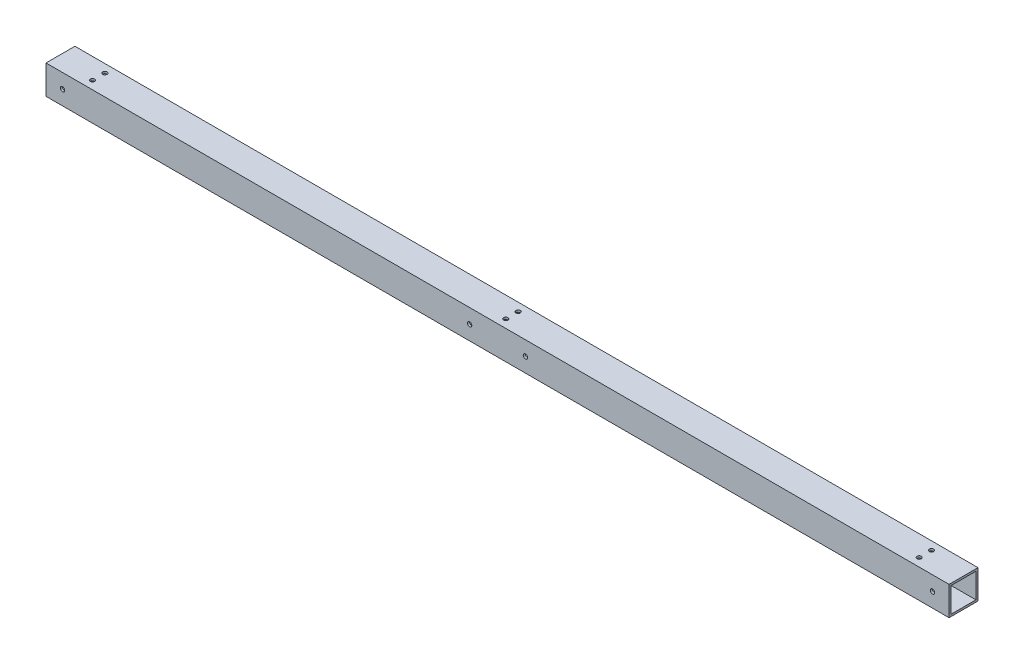
ISO-10303-21;
HEADER;
FILE_DESCRIPTION(('STEP AP214'),'2;1');
FILE_NAME('part.step','',(''),(''),'','','');
FILE_SCHEMA(('AUTOMOTIVE_DESIGN { 1 0 10303 214 1 1 1 1 }'));
ENDSEC;
DATA;
#1=APPLICATION_CONTEXT('core data for automotive mechanical design processes');
#2=APPLICATION_PROTOCOL_DEFINITION('international standard','automotive_design',2000,#1);
#3=PRODUCT_CONTEXT('',#1,'mechanical');
#4=PRODUCT('Part','Part','',(#3));
#5=PRODUCT_RELATED_PRODUCT_CATEGORY('part','',(#4));
#6=PRODUCT_DEFINITION_FORMATION('','',#4);
#7=PRODUCT_DEFINITION_CONTEXT('part definition',#1,'design');
#8=PRODUCT_DEFINITION('design','',#6,#7);
#9=PRODUCT_DEFINITION_SHAPE('','',#8);
#10=(LENGTH_UNIT() NAMED_UNIT(*) SI_UNIT(.MILLI.,.METRE.));
#11=(NAMED_UNIT(*) PLANE_ANGLE_UNIT() SI_UNIT($,.RADIAN.));
#12=(NAMED_UNIT(*) SI_UNIT($,.STERADIAN.) SOLID_ANGLE_UNIT());
#13=UNCERTAINTY_MEASURE_WITH_UNIT(LENGTH_MEASURE(1.E-05),#10,'distance_accuracy_value','');
#14=(GEOMETRIC_REPRESENTATION_CONTEXT(3) GLOBAL_UNCERTAINTY_ASSIGNED_CONTEXT((#13)) GLOBAL_UNIT_ASSIGNED_CONTEXT((#10,
#11,#12)) REPRESENTATION_CONTEXT('',''));
#15=CARTESIAN_POINT('',(0.,0.,0.));
#16=DIRECTION('',(0.,0.,1.));
#17=DIRECTION('',(1.,0.,0.));
#18=AXIS2_PLACEMENT_3D('',#15,#16,#17);
#19=CARTESIAN_POINT('',(-693.7375,-22.225,-22.225));
#20=DIRECTION('',(0.,0.,-1.));
#21=DIRECTION('',(-1.,0.,0.));
#22=AXIS2_PLACEMENT_3D('',#19,#20,#21);
#23=PLANE('',#22);
#24=CARTESIAN_POINT('',(42.8624999999999,2.33146835171283E-12,-22.225));
#25=DIRECTION('',(0.,0.,1.));
#26=DIRECTION('',(1.,0.,0.));
#27=AXIS2_PLACEMENT_3D('',#24,#25,#26);
#28=CIRCLE('',#27,3.37350099999999);
#29=CARTESIAN_POINT('',(46.2360009999999,2.33146835171283E-12,-22.225));
#30=VERTEX_POINT('',#29);
#31=EDGE_CURVE('E225',#30,#30,#28,.T.);
#32=ORIENTED_EDGE('',*,*,#31,.T.);
#33=EDGE_LOOP('',(#32));
#34=FACE_BOUND('',#33,.T.);
#35=CARTESIAN_POINT('',(-668.3375,0.,-22.225));
#36=DIRECTION('',(0.,0.,1.));
#37=DIRECTION('',(1.,0.,0.));
#38=AXIS2_PLACEMENT_3D('',#35,#36,#37);
#39=CIRCLE('',#38,3.373501);
#40=CARTESIAN_POINT('',(-664.963999,0.,-22.225));
#41=VERTEX_POINT('',#40);
#42=EDGE_CURVE('E219',#41,#41,#39,.T.);
#43=ORIENTED_EDGE('',*,*,#42,.T.);
#44=EDGE_LOOP('',(#43));
#45=FACE_BOUND('',#44,.T.);
#46=CARTESIAN_POINT('',(668.3375,2.33146835171283E-12,-22.225));
#47=DIRECTION('',(0.,0.,1.));
#48=DIRECTION('',(1.,0.,0.));
#49=AXIS2_PLACEMENT_3D('',#46,#47,#48);
#50=CIRCLE('',#49,3.373501);
#51=CARTESIAN_POINT('',(671.711001,2.33146835171283E-12,-22.225));
#52=VERTEX_POINT('',#51);
#53=EDGE_CURVE('E213',#52,#52,#50,.T.);
#54=ORIENTED_EDGE('',*,*,#53,.T.);
#55=EDGE_LOOP('',(#54));
#56=FACE_BOUND('',#55,.T.);
#57=CARTESIAN_POINT('',(-42.8625000000004,0.,-22.225));
#58=DIRECTION('',(0.,0.,1.));
#59=DIRECTION('',(1.,0.,0.));
#60=AXIS2_PLACEMENT_3D('',#57,#58,#59);
#61=CIRCLE('',#60,3.37350099999999);
#62=CARTESIAN_POINT('',(-39.4889990000004,0.,-22.225));
#63=VERTEX_POINT('',#62);
#64=EDGE_CURVE('E207',#63,#63,#61,.T.);
#65=ORIENTED_EDGE('',*,*,#64,.T.);
#66=EDGE_LOOP('',(#65));
#67=FACE_BOUND('',#66,.T.);
#68=DIRECTION('',(1.,0.,0.));
#69=VECTOR('',#68,1.);
#70=CARTESIAN_POINT('',(-693.7375,22.225,-22.225));
#71=LINE('',#70,#69);
#72=CARTESIAN_POINT('',(-693.7375,22.225,-22.225));
#73=VERTEX_POINT('',#72);
#74=CARTESIAN_POINT('',(693.7375,22.2250000000023,-22.225));
#75=VERTEX_POINT('',#74);
#76=EDGE_CURVE('E194',#73,#75,#71,.T.);
#77=ORIENTED_EDGE('',*,*,#76,.T.);
#78=DIRECTION('',(0.,1.,0.));
#79=VECTOR('',#78,1.);
#80=CARTESIAN_POINT('',(693.7375,-22.2249999999977,-22.225));
#81=LINE('',#80,#79);
#82=CARTESIAN_POINT('',(693.7375,-22.2249999999977,-22.225));
#83=VERTEX_POINT('',#82);
#84=EDGE_CURVE('E147',#83,#75,#81,.T.);
#85=ORIENTED_EDGE('',*,*,#84,.F.);
#86=DIRECTION('',(1.,0.,0.));
#87=VECTOR('',#86,1.);
#88=CARTESIAN_POINT('',(-693.7375,-22.225,-22.225));
#89=LINE('',#88,#87);
#90=CARTESIAN_POINT('',(-693.7375,-22.225,-22.225));
#91=VERTEX_POINT('',#90);
#92=EDGE_CURVE('E11',#91,#83,#89,.T.);
#93=ORIENTED_EDGE('',*,*,#92,.F.);
#94=DIRECTION('',(0.,1.,0.));
#95=VECTOR('',#94,1.);
#96=CARTESIAN_POINT('',(-693.7375,-22.225,-22.225));
#97=LINE('',#96,#95);
#98=EDGE_CURVE('E175',#91,#73,#97,.T.);
#99=ORIENTED_EDGE('',*,*,#98,.T.);
#100=EDGE_LOOP('',(#77,#85,#93,#99));
#101=FACE_BOUND('',#100,.T.);
#102=ADVANCED_FACE('F43',(#34,#45,#56,#67,#101),#23,.T.);
#103=CARTESIAN_POINT('',(-693.7375,-22.225,22.225));
#104=DIRECTION('',(0.,-1.,0.));
#105=DIRECTION('',(0.,0.,-1.));
#106=AXIS2_PLACEMENT_3D('',#103,#104,#105);
#107=PLANE('',#106);
#108=CARTESIAN_POINT('',(0.,-22.225,-9.525));
#109=DIRECTION('',(0.,-1.,0.));
#110=DIRECTION('',(0.,0.,-1.));
#111=AXIS2_PLACEMENT_3D('',#108,#109,#110);
#112=CIRCLE('',#111,3.37350099999999);
#113=CARTESIAN_POINT('',(0.,-22.225,-12.898501));
#114=VERTEX_POINT('',#113);
#115=EDGE_CURVE('E621',#114,#114,#112,.T.);
#116=ORIENTED_EDGE('',*,*,#115,.F.);
#117=EDGE_LOOP('',(#116));
#118=FACE_BOUND('',#117,.T.);
#119=CARTESIAN_POINT('',(0.,-22.225,9.525));
#120=DIRECTION('',(0.,-1.,0.));
#121=DIRECTION('',(0.,0.,-1.));
#122=AXIS2_PLACEMENT_3D('',#119,#120,#121);
#123=CIRCLE('',#122,3.37350099999999);
#124=CARTESIAN_POINT('',(0.,-22.225,6.15149900000001));
#125=VERTEX_POINT('',#124);
#126=EDGE_CURVE('E257',#125,#125,#123,.T.);
#127=ORIENTED_EDGE('',*,*,#126,.F.);
#128=EDGE_LOOP('',(#127));
#129=FACE_BOUND('',#128,.T.);
#130=CARTESIAN_POINT('',(635.,-22.2249999999977,-9.525));
#131=DIRECTION('',(0.,-1.,0.));
#132=DIRECTION('',(0.,0.,-1.));
#133=AXIS2_PLACEMENT_3D('',#130,#131,#132);
#134=CIRCLE('',#133,3.373501);
#135=CARTESIAN_POINT('',(635.,-22.2249999999977,-12.898501));
#136=VERTEX_POINT('',#135);
#137=EDGE_CURVE('E254',#136,#136,#134,.T.);
#138=ORIENTED_EDGE('',*,*,#137,.F.);
#139=EDGE_LOOP('',(#138));
#140=FACE_BOUND('',#139,.T.);
#141=CARTESIAN_POINT('',(635.,-22.2249999999977,9.525));
#142=DIRECTION('',(0.,-1.,0.));
#143=DIRECTION('',(0.,0.,-1.));
#144=AXIS2_PLACEMENT_3D('',#141,#142,#143);
#145=CIRCLE('',#144,3.373501);
#146=CARTESIAN_POINT('',(635.,-22.2249999999977,6.151499));
#147=VERTEX_POINT('',#146);
#148=EDGE_CURVE('E277',#147,#147,#145,.T.);
#149=ORIENTED_EDGE('',*,*,#148,.F.);
#150=EDGE_LOOP('',(#149));
#151=FACE_BOUND('',#150,.T.);
#152=CARTESIAN_POINT('',(-635.,-22.225,9.525));
#153=DIRECTION('',(0.,-1.,0.));
#154=DIRECTION('',(0.,0.,-1.));
#155=AXIS2_PLACEMENT_3D('',#152,#153,#154);
#156=CIRCLE('',#155,3.373501);
#157=CARTESIAN_POINT('',(-635.,-22.225,6.151499));
#158=VERTEX_POINT('',#157);
#159=EDGE_CURVE('E293',#158,#158,#156,.T.);
#160=ORIENTED_EDGE('',*,*,#159,.F.);
#161=EDGE_LOOP('',(#160));
#162=FACE_BOUND('',#161,.T.);
#163=CARTESIAN_POINT('',(-635.,-22.225,-9.525));
#164=DIRECTION('',(0.,-1.,0.));
#165=DIRECTION('',(0.,0.,-1.));
#166=AXIS2_PLACEMENT_3D('',#163,#164,#165);
#167=CIRCLE('',#166,3.373501);
#168=CARTESIAN_POINT('',(-635.,-22.225,-12.898501));
#169=VERTEX_POINT('',#168);
#170=EDGE_CURVE('E303',#169,#169,#167,.T.);
#171=ORIENTED_EDGE('',*,*,#170,.F.);
#172=EDGE_LOOP('',(#171));
#173=FACE_BOUND('',#172,.T.);
#174=ORIENTED_EDGE('',*,*,#92,.T.);
#175=DIRECTION('',(0.,0.,-1.));
#176=VECTOR('',#175,1.);
#177=CARTESIAN_POINT('',(693.7375,-22.2249999999977,22.225));
#178=LINE('',#177,#176);
#179=CARTESIAN_POINT('',(693.7375,-22.2249999999977,22.225));
#180=VERTEX_POINT('',#179);
#181=EDGE_CURVE('E159',#180,#83,#178,.T.);
#182=ORIENTED_EDGE('',*,*,#181,.F.);
#183=DIRECTION('',(1.,0.,0.));
#184=VECTOR('',#183,1.);
#185=CARTESIAN_POINT('',(-693.7375,-22.225,22.225));
#186=LINE('',#185,#184);
#187=CARTESIAN_POINT('',(-693.7375,-22.225,22.225));
#188=VERTEX_POINT('',#187);
#189=EDGE_CURVE('E52',#188,#180,#186,.T.);
#190=ORIENTED_EDGE('',*,*,#189,.F.);
#191=DIRECTION('',(0.,0.,-1.));
#192=VECTOR('',#191,1.);
#193=CARTESIAN_POINT('',(-693.7375,-22.225,22.225));
#194=LINE('',#193,#192);
#195=EDGE_CURVE('E191',#188,#91,#194,.T.);
#196=ORIENTED_EDGE('',*,*,#195,.T.);
#197=EDGE_LOOP('',(#174,#182,#190,#196));
#198=FACE_BOUND('',#197,.T.);
#199=ADVANCED_FACE('F372',(#118,#129,#140,#151,#162,#173,#198),#107,.T.);
#200=CARTESIAN_POINT('',(-693.7375,-22.225,22.225));
#201=DIRECTION('',(0.,0.,1.));
#202=DIRECTION('',(1.,0.,0.));
#203=AXIS2_PLACEMENT_3D('',#200,#201,#202);
#204=PLANE('',#203);
#205=CARTESIAN_POINT('',(42.8624999999999,2.33146835171283E-12,22.225));
#206=DIRECTION('',(0.,0.,1.));
#207=DIRECTION('',(1.,0.,0.));
#208=AXIS2_PLACEMENT_3D('',#205,#206,#207);
#209=CIRCLE('',#208,3.37350099999999);
#210=CARTESIAN_POINT('',(46.2360009999999,2.33146835171283E-12,22.225));
#211=VERTEX_POINT('',#210);
#212=EDGE_CURVE('E313',#211,#211,#209,.T.);
#213=ORIENTED_EDGE('',*,*,#212,.F.);
#214=EDGE_LOOP('',(#213));
#215=FACE_BOUND('',#214,.T.);
#216=CARTESIAN_POINT('',(-668.3375,0.,22.225));
#217=DIRECTION('',(0.,0.,1.));
#218=DIRECTION('',(1.,0.,0.));
#219=AXIS2_PLACEMENT_3D('',#216,#217,#218);
#220=CIRCLE('',#219,3.373501);
#221=CARTESIAN_POINT('',(-664.963999,0.,22.225));
#222=VERTEX_POINT('',#221);
#223=EDGE_CURVE('E323',#222,#222,#220,.T.);
#224=ORIENTED_EDGE('',*,*,#223,.F.);
#225=EDGE_LOOP('',(#224));
#226=FACE_BOUND('',#225,.T.);
#227=CARTESIAN_POINT('',(668.3375,2.33146835171283E-12,22.225));
#228=DIRECTION('',(0.,0.,1.));
#229=DIRECTION('',(1.,0.,0.));
#230=AXIS2_PLACEMENT_3D('',#227,#228,#229);
#231=CIRCLE('',#230,3.373501);
#232=CARTESIAN_POINT('',(671.711001,2.33146835171283E-12,22.225));
#233=VERTEX_POINT('',#232);
#234=EDGE_CURVE('E333',#233,#233,#231,.T.);
#235=ORIENTED_EDGE('',*,*,#234,.F.);
#236=EDGE_LOOP('',(#235));
#237=FACE_BOUND('',#236,.T.);
#238=CARTESIAN_POINT('',(-42.8625000000004,0.,22.225));
#239=DIRECTION('',(0.,0.,1.));
#240=DIRECTION('',(1.,0.,0.));
#241=AXIS2_PLACEMENT_3D('',#238,#239,#240);
#242=CIRCLE('',#241,3.37350099999999);
#243=CARTESIAN_POINT('',(-39.4889990000004,0.,22.225));
#244=VERTEX_POINT('',#243);
#245=EDGE_CURVE('E343',#244,#244,#242,.T.);
#246=ORIENTED_EDGE('',*,*,#245,.F.);
#247=EDGE_LOOP('',(#246));
#248=FACE_BOUND('',#247,.T.);
#249=ORIENTED_EDGE('',*,*,#189,.T.);
#250=DIRECTION('',(0.,-1.,0.));
#251=VECTOR('',#250,1.);
#252=CARTESIAN_POINT('',(693.7375,-22.2249999999977,22.225));
#253=LINE('',#252,#251);
#254=CARTESIAN_POINT('',(693.7375,22.2250000000023,22.225));
#255=VERTEX_POINT('',#254);
#256=EDGE_CURVE('E155',#255,#180,#253,.T.);
#257=ORIENTED_EDGE('',*,*,#256,.F.);
#258=DIRECTION('',(1.,0.,0.));
#259=VECTOR('',#258,1.);
#260=CARTESIAN_POINT('',(-693.7375,22.225,22.225));
#261=LINE('',#260,#259);
#262=CARTESIAN_POINT('',(-693.7375,22.225,22.225));
#263=VERTEX_POINT('',#262);
#264=EDGE_CURVE('E198',#263,#255,#261,.T.);
#265=ORIENTED_EDGE('',*,*,#264,.F.);
#266=DIRECTION('',(0.,-1.,0.));
#267=VECTOR('',#266,1.);
#268=CARTESIAN_POINT('',(-693.7375,-22.225,22.225));
#269=LINE('',#268,#267);
#270=EDGE_CURVE('E187',#263,#188,#269,.T.);
#271=ORIENTED_EDGE('',*,*,#270,.T.);
#272=EDGE_LOOP('',(#249,#257,#265,#271));
#273=FACE_BOUND('',#272,.T.);
#274=ADVANCED_FACE('F377',(#215,#226,#237,#248,#273),#204,.T.);
#275=CARTESIAN_POINT('',(-693.7375,22.225,22.225));
#276=DIRECTION('',(0.,1.,0.));
#277=DIRECTION('',(0.,0.,1.));
#278=AXIS2_PLACEMENT_3D('',#275,#276,#277);
#279=PLANE('',#278);
#280=CARTESIAN_POINT('',(0.,22.225,-9.525));
#281=DIRECTION('',(0.,-1.,0.));
#282=DIRECTION('',(0.,0.,-1.));
#283=AXIS2_PLACEMENT_3D('',#280,#281,#282);
#284=CIRCLE('',#283,3.37350099999999);
#285=CARTESIAN_POINT('',(0.,22.225,-12.898501));
#286=VERTEX_POINT('',#285);
#287=EDGE_CURVE('E611',#286,#286,#284,.T.);
#288=ORIENTED_EDGE('',*,*,#287,.T.);
#289=EDGE_LOOP('',(#288));
#290=FACE_BOUND('',#289,.T.);
#291=CARTESIAN_POINT('',(0.,22.225,9.525));
#292=DIRECTION('',(0.,-1.,0.));
#293=DIRECTION('',(0.,0.,-1.));
#294=AXIS2_PLACEMENT_3D('',#291,#292,#293);
#295=CIRCLE('',#294,3.37350099999999);
#296=CARTESIAN_POINT('',(0.,22.225,6.15149900000001));
#297=VERTEX_POINT('',#296);
#298=EDGE_CURVE('E247',#297,#297,#295,.T.);
#299=ORIENTED_EDGE('',*,*,#298,.T.);
#300=EDGE_LOOP('',(#299));
#301=FACE_BOUND('',#300,.T.);
#302=CARTESIAN_POINT('',(635.,22.2250000000023,-9.525));
#303=DIRECTION('',(0.,-1.,0.));
#304=DIRECTION('',(0.,0.,-1.));
#305=AXIS2_PLACEMENT_3D('',#302,#303,#304);
#306=CIRCLE('',#305,3.373501);
#307=CARTESIAN_POINT('',(635.,22.2250000000023,-12.898501));
#308=VERTEX_POINT('',#307);
#309=EDGE_CURVE('E242',#308,#308,#306,.T.);
#310=ORIENTED_EDGE('',*,*,#309,.T.);
#311=EDGE_LOOP('',(#310));
#312=FACE_BOUND('',#311,.T.);
#313=CARTESIAN_POINT('',(635.,22.2250000000023,9.525));
#314=DIRECTION('',(0.,-1.,0.));
#315=DIRECTION('',(0.,0.,-1.));
#316=AXIS2_PLACEMENT_3D('',#313,#314,#315);
#317=CIRCLE('',#316,3.373501);
#318=CARTESIAN_POINT('',(635.,22.2250000000023,6.151499));
#319=VERTEX_POINT('',#318);
#320=EDGE_CURVE('E281',#319,#319,#317,.T.);
#321=ORIENTED_EDGE('',*,*,#320,.T.);
#322=EDGE_LOOP('',(#321));
#323=FACE_BOUND('',#322,.T.);
#324=CARTESIAN_POINT('',(-635.,22.225,9.525));
#325=DIRECTION('',(0.,-1.,0.));
#326=DIRECTION('',(0.,0.,-1.));
#327=AXIS2_PLACEMENT_3D('',#324,#325,#326);
#328=CIRCLE('',#327,3.373501);
#329=CARTESIAN_POINT('',(-635.,22.225,6.151499));
#330=VERTEX_POINT('',#329);
#331=EDGE_CURVE('E237',#330,#330,#328,.T.);
#332=ORIENTED_EDGE('',*,*,#331,.T.);
#333=EDGE_LOOP('',(#332));
#334=FACE_BOUND('',#333,.T.);
#335=CARTESIAN_POINT('',(-635.,22.225,-9.525));
#336=DIRECTION('',(0.,-1.,0.));
#337=DIRECTION('',(0.,0.,-1.));
#338=AXIS2_PLACEMENT_3D('',#335,#336,#337);
#339=CIRCLE('',#338,3.373501);
#340=CARTESIAN_POINT('',(-635.,22.225,-12.898501));
#341=VERTEX_POINT('',#340);
#342=EDGE_CURVE('E231',#341,#341,#339,.T.);
#343=ORIENTED_EDGE('',*,*,#342,.T.);
#344=EDGE_LOOP('',(#343));
#345=FACE_BOUND('',#344,.T.);
#346=ORIENTED_EDGE('',*,*,#264,.T.);
#347=DIRECTION('',(0.,0.,1.));
#348=VECTOR('',#347,1.);
#349=CARTESIAN_POINT('',(693.7375,22.2250000000023,22.225));
#350=LINE('',#349,#348);
#351=EDGE_CURVE('E151',#75,#255,#350,.T.);
#352=ORIENTED_EDGE('',*,*,#351,.F.);
#353=ORIENTED_EDGE('',*,*,#76,.F.);
#354=DIRECTION('',(0.,0.,1.));
#355=VECTOR('',#354,1.);
#356=CARTESIAN_POINT('',(-693.7375,22.225,22.225));
#357=LINE('',#356,#355);
#358=EDGE_CURVE('E183',#73,#263,#357,.T.);
#359=ORIENTED_EDGE('',*,*,#358,.T.);
#360=EDGE_LOOP('',(#346,#352,#353,#359));
#361=FACE_BOUND('',#360,.T.);
#362=ADVANCED_FACE('F389',(#290,#301,#312,#323,#334,#345,#361),#279,.T.);
#363=CARTESIAN_POINT('',(-693.7375,0.,0.));
#364=DIRECTION('',(-1.,0.,0.));
#365=DIRECTION('',(0.,0.,1.));
#366=AXIS2_PLACEMENT_3D('',#363,#364,#365);
#367=PLANE('',#366);
#368=DIRECTION('',(0.,1.,0.));
#369=VECTOR('',#368,1.);
#370=CARTESIAN_POINT('',(-693.7375,-19.05,-19.05));
#371=LINE('',#370,#369);
#372=CARTESIAN_POINT('',(-693.7375,-19.05,-19.05));
#373=VERTEX_POINT('',#372);
#374=CARTESIAN_POINT('',(-693.7375,19.05,-19.05));
#375=VERTEX_POINT('',#374);
#376=EDGE_CURVE('E163',#373,#375,#371,.T.);
#377=ORIENTED_EDGE('',*,*,#376,.T.);
#378=DIRECTION('',(0.,0.,1.));
#379=VECTOR('',#378,1.);
#380=CARTESIAN_POINT('',(-693.7375,19.05,19.05));
#381=LINE('',#380,#379);
#382=CARTESIAN_POINT('',(-693.7375,19.05,19.05));
#383=VERTEX_POINT('',#382);
#384=EDGE_CURVE('E116',#375,#383,#381,.T.);
#385=ORIENTED_EDGE('',*,*,#384,.T.);
#386=DIRECTION('',(0.,-1.,0.));
#387=VECTOR('',#386,1.);
#388=CARTESIAN_POINT('',(-693.7375,-19.05,19.05));
#389=LINE('',#388,#387);
#390=CARTESIAN_POINT('',(-693.7375,-19.05,19.05));
#391=VERTEX_POINT('',#390);
#392=EDGE_CURVE('E60',#383,#391,#389,.T.);
#393=ORIENTED_EDGE('',*,*,#392,.T.);
#394=DIRECTION('',(0.,0.,-1.));
#395=VECTOR('',#394,1.);
#396=CARTESIAN_POINT('',(-693.7375,-19.05,19.05));
#397=LINE('',#396,#395);
#398=EDGE_CURVE('E122',#391,#373,#397,.T.);
#399=ORIENTED_EDGE('',*,*,#398,.T.);
#400=EDGE_LOOP('',(#377,#385,#393,#399));
#401=FACE_BOUND('',#400,.T.);
#402=ORIENTED_EDGE('',*,*,#98,.F.);
#403=ORIENTED_EDGE('',*,*,#195,.F.);
#404=ORIENTED_EDGE('',*,*,#270,.F.);
#405=ORIENTED_EDGE('',*,*,#358,.F.);
#406=EDGE_LOOP('',(#402,#403,#404,#405));
#407=FACE_BOUND('',#406,.T.);
#408=ADVANCED_FACE('F397',(#401,#407),#367,.T.);
#409=CARTESIAN_POINT('',(-693.7375,-19.05,-19.05));
#410=DIRECTION('',(0.,0.,-1.));
#411=DIRECTION('',(-1.,0.,0.));
#412=AXIS2_PLACEMENT_3D('',#409,#410,#411);
#413=PLANE('',#412);
#414=CARTESIAN_POINT('',(42.8624999999999,2.33146835171283E-12,-19.05));
#415=DIRECTION('',(0.,0.,-1.));
#416=DIRECTION('',(-1.,0.,0.));
#417=AXIS2_PLACEMENT_3D('',#414,#415,#416);
#418=CIRCLE('',#417,3.37350099999999);
#419=CARTESIAN_POINT('',(39.4889989999999,2.33146835171283E-12,-19.05));
#420=VERTEX_POINT('',#419);
#421=EDGE_CURVE('E224',#420,#420,#418,.T.);
#422=ORIENTED_EDGE('',*,*,#421,.T.);
#423=EDGE_LOOP('',(#422));
#424=FACE_BOUND('',#423,.T.);
#425=CARTESIAN_POINT('',(-668.3375,0.,-19.05));
#426=DIRECTION('',(0.,0.,-1.));
#427=DIRECTION('',(-1.,0.,0.));
#428=AXIS2_PLACEMENT_3D('',#425,#426,#427);
#429=CIRCLE('',#428,3.373501);
#430=CARTESIAN_POINT('',(-671.711001,0.,-19.05));
#431=VERTEX_POINT('',#430);
#432=EDGE_CURVE('E214',#431,#431,#429,.T.);
#433=ORIENTED_EDGE('',*,*,#432,.T.);
#434=EDGE_LOOP('',(#433));
#435=FACE_BOUND('',#434,.T.);
#436=CARTESIAN_POINT('',(668.3375,2.33146835171283E-12,-19.05));
#437=DIRECTION('',(0.,0.,-1.));
#438=DIRECTION('',(-1.,0.,0.));
#439=AXIS2_PLACEMENT_3D('',#436,#437,#438);
#440=CIRCLE('',#439,3.373501);
#441=CARTESIAN_POINT('',(664.963999,2.33146835171283E-12,-19.05));
#442=VERTEX_POINT('',#441);
#443=EDGE_CURVE('E208',#442,#442,#440,.T.);
#444=ORIENTED_EDGE('',*,*,#443,.T.);
#445=EDGE_LOOP('',(#444));
#446=FACE_BOUND('',#445,.T.);
#447=CARTESIAN_POINT('',(-42.8625000000004,0.,-19.05));
#448=DIRECTION('',(0.,0.,-1.));
#449=DIRECTION('',(-1.,0.,0.));
#450=AXIS2_PLACEMENT_3D('',#447,#448,#449);
#451=CIRCLE('',#450,3.37350099999999);
#452=CARTESIAN_POINT('',(-46.2360010000003,0.,-19.05));
#453=VERTEX_POINT('',#452);
#454=EDGE_CURVE('E132',#453,#453,#451,.T.);
#455=ORIENTED_EDGE('',*,*,#454,.T.);
#456=EDGE_LOOP('',(#455));
#457=FACE_BOUND('',#456,.T.);
#458=DIRECTION('',(1.,0.,0.));
#459=VECTOR('',#458,1.);
#460=CARTESIAN_POINT('',(-693.7375,-19.05,-19.05));
#461=LINE('',#460,#459);
#462=CARTESIAN_POINT('',(693.7375,-19.0499999999977,-19.05));
#463=VERTEX_POINT('',#462);
#464=EDGE_CURVE('E127',#373,#463,#461,.T.);
#465=ORIENTED_EDGE('',*,*,#464,.T.);
#466=DIRECTION('',(0.,1.,0.));
#467=VECTOR('',#466,1.);
#468=CARTESIAN_POINT('',(693.7375,-19.0499999999977,-19.05));
#469=LINE('',#468,#467);
#470=CARTESIAN_POINT('',(693.7375,19.0500000000023,-19.05));
#471=VERTEX_POINT('',#470);
#472=EDGE_CURVE('E125',#463,#471,#469,.T.);
#473=ORIENTED_EDGE('',*,*,#472,.T.);
#474=DIRECTION('',(1.,0.,0.));
#475=VECTOR('',#474,1.);
#476=CARTESIAN_POINT('',(-693.7375,19.05,-19.05));
#477=LINE('',#476,#475);
#478=EDGE_CURVE('E109',#375,#471,#477,.T.);
#479=ORIENTED_EDGE('',*,*,#478,.F.);
#480=ORIENTED_EDGE('',*,*,#376,.F.);
#481=EDGE_LOOP('',(#465,#473,#479,#480));
#482=FACE_BOUND('',#481,.T.);
#483=ADVANCED_FACE('F126',(#424,#435,#446,#457,#482),#413,.F.);
#484=CARTESIAN_POINT('',(-693.7375,-19.05,19.05));
#485=DIRECTION('',(0.,-1.,0.));
#486=DIRECTION('',(0.,0.,-1.));
#487=AXIS2_PLACEMENT_3D('',#484,#485,#486);
#488=PLANE('',#487);
#489=CARTESIAN_POINT('',(0.,-19.05,-9.525));
#490=DIRECTION('',(0.,-1.,0.));
#491=DIRECTION('',(0.,0.,-1.));
#492=AXIS2_PLACEMENT_3D('',#489,#490,#491);
#493=CIRCLE('',#492,3.37350099999999);
#494=CARTESIAN_POINT('',(0.,-19.05,-12.898501));
#495=VERTEX_POINT('',#494);
#496=EDGE_CURVE('E46',#495,#495,#493,.T.);
#497=ORIENTED_EDGE('',*,*,#496,.T.);
#498=EDGE_LOOP('',(#497));
#499=FACE_BOUND('',#498,.T.);
#500=CARTESIAN_POINT('',(0.,-19.05,9.525));
#501=DIRECTION('',(0.,-1.,0.));
#502=DIRECTION('',(0.,0.,-1.));
#503=AXIS2_PLACEMENT_3D('',#500,#501,#502);
#504=CIRCLE('',#503,3.37350099999999);
#505=CARTESIAN_POINT('',(0.,-19.05,6.15149900000001));
#506=VERTEX_POINT('',#505);
#507=EDGE_CURVE('E246',#506,#506,#504,.T.);
#508=ORIENTED_EDGE('',*,*,#507,.T.);
#509=EDGE_LOOP('',(#508));
#510=FACE_BOUND('',#509,.T.);
#511=CARTESIAN_POINT('',(635.,-19.0499999999977,-9.525));
#512=DIRECTION('',(0.,-1.,0.));
#513=DIRECTION('',(0.,0.,-1.));
#514=AXIS2_PLACEMENT_3D('',#511,#512,#513);
#515=CIRCLE('',#514,3.373501);
#516=CARTESIAN_POINT('',(635.,-19.0499999999977,-12.898501));
#517=VERTEX_POINT('',#516);
#518=EDGE_CURVE('E241',#517,#517,#515,.T.);
#519=ORIENTED_EDGE('',*,*,#518,.T.);
#520=EDGE_LOOP('',(#519));
#521=FACE_BOUND('',#520,.T.);
#522=CARTESIAN_POINT('',(635.,-19.0499999999977,9.525));
#523=DIRECTION('',(0.,-1.,0.));
#524=DIRECTION('',(0.,0.,-1.));
#525=AXIS2_PLACEMENT_3D('',#522,#523,#524);
#526=CIRCLE('',#525,3.373501);
#527=CARTESIAN_POINT('',(635.,-19.0499999999977,6.151499));
#528=VERTEX_POINT('',#527);
#529=EDGE_CURVE('E285',#528,#528,#526,.T.);
#530=ORIENTED_EDGE('',*,*,#529,.T.);
#531=EDGE_LOOP('',(#530));
#532=FACE_BOUND('',#531,.T.);
#533=CARTESIAN_POINT('',(-635.,-19.05,9.525));
#534=DIRECTION('',(0.,-1.,0.));
#535=DIRECTION('',(0.,0.,-1.));
#536=AXIS2_PLACEMENT_3D('',#533,#534,#535);
#537=CIRCLE('',#536,3.373501);
#538=CARTESIAN_POINT('',(-635.,-19.05,6.151499));
#539=VERTEX_POINT('',#538);
#540=EDGE_CURVE('E236',#539,#539,#537,.T.);
#541=ORIENTED_EDGE('',*,*,#540,.T.);
#542=EDGE_LOOP('',(#541));
#543=FACE_BOUND('',#542,.T.);
#544=CARTESIAN_POINT('',(-635.,-19.05,-9.525));
#545=DIRECTION('',(0.,-1.,0.));
#546=DIRECTION('',(0.,0.,-1.));
#547=AXIS2_PLACEMENT_3D('',#544,#545,#546);
#548=CIRCLE('',#547,3.373501);
#549=CARTESIAN_POINT('',(-635.,-19.05,-12.898501));
#550=VERTEX_POINT('',#549);
#551=EDGE_CURVE('E226',#550,#550,#548,.T.);
#552=ORIENTED_EDGE('',*,*,#551,.T.);
#553=EDGE_LOOP('',(#552));
#554=FACE_BOUND('',#553,.T.);
#555=DIRECTION('',(1.,0.,0.));
#556=VECTOR('',#555,1.);
#557=CARTESIAN_POINT('',(-693.7375,-19.05,19.05));
#558=LINE('',#557,#556);
#559=CARTESIAN_POINT('',(693.7375,-19.0499999999977,19.05));
#560=VERTEX_POINT('',#559);
#561=EDGE_CURVE('E176',#391,#560,#558,.T.);
#562=ORIENTED_EDGE('',*,*,#561,.T.);
#563=DIRECTION('',(0.,0.,-1.));
#564=VECTOR('',#563,1.);
#565=CARTESIAN_POINT('',(693.7375,-19.0499999999977,19.05));
#566=LINE('',#565,#564);
#567=EDGE_CURVE('E141',#560,#463,#566,.T.);
#568=ORIENTED_EDGE('',*,*,#567,.T.);
#569=ORIENTED_EDGE('',*,*,#464,.F.);
#570=ORIENTED_EDGE('',*,*,#398,.F.);
#571=EDGE_LOOP('',(#562,#568,#569,#570));
#572=FACE_BOUND('',#571,.T.);
#573=ADVANCED_FACE('F414',(#499,#510,#521,#532,#543,#554,#572),#488,.F.);
#574=CARTESIAN_POINT('',(-693.7375,-19.05,19.05));
#575=DIRECTION('',(0.,0.,1.));
#576=DIRECTION('',(1.,0.,0.));
#577=AXIS2_PLACEMENT_3D('',#574,#575,#576);
#578=PLANE('',#577);
#579=CARTESIAN_POINT('',(42.8624999999999,2.33146835171283E-12,19.05));
#580=DIRECTION('',(0.,0.,1.));
#581=DIRECTION('',(1.,0.,0.));
#582=AXIS2_PLACEMENT_3D('',#579,#580,#581);
#583=CIRCLE('',#582,3.37350099999999);
#584=CARTESIAN_POINT('',(46.2360009999999,2.33146835171283E-12,19.05));
#585=VERTEX_POINT('',#584);
#586=EDGE_CURVE('E220',#585,#585,#583,.T.);
#587=ORIENTED_EDGE('',*,*,#586,.T.);
#588=EDGE_LOOP('',(#587));
#589=FACE_BOUND('',#588,.T.);
#590=CARTESIAN_POINT('',(-668.3375,0.,19.05));
#591=DIRECTION('',(0.,0.,1.));
#592=DIRECTION('',(1.,0.,0.));
#593=AXIS2_PLACEMENT_3D('',#590,#591,#592);
#594=CIRCLE('',#593,3.373501);
#595=CARTESIAN_POINT('',(-664.963999,0.,19.05));
#596=VERTEX_POINT('',#595);
#597=EDGE_CURVE('E218',#596,#596,#594,.T.);
#598=ORIENTED_EDGE('',*,*,#597,.T.);
#599=EDGE_LOOP('',(#598));
#600=FACE_BOUND('',#599,.T.);
#601=CARTESIAN_POINT('',(668.3375,2.33146835171283E-12,19.05));
#602=DIRECTION('',(0.,0.,1.));
#603=DIRECTION('',(1.,0.,0.));
#604=AXIS2_PLACEMENT_3D('',#601,#602,#603);
#605=CIRCLE('',#604,3.373501);
#606=CARTESIAN_POINT('',(671.711001,2.33146835171283E-12,19.05));
#607=VERTEX_POINT('',#606);
#608=EDGE_CURVE('E212',#607,#607,#605,.T.);
#609=ORIENTED_EDGE('',*,*,#608,.T.);
#610=EDGE_LOOP('',(#609));
#611=FACE_BOUND('',#610,.T.);
#612=CARTESIAN_POINT('',(-42.8625000000004,0.,19.05));
#613=DIRECTION('',(0.,0.,1.));
#614=DIRECTION('',(1.,0.,0.));
#615=AXIS2_PLACEMENT_3D('',#612,#613,#614);
#616=CIRCLE('',#615,3.37350099999999);
#617=CARTESIAN_POINT('',(-39.4889990000004,0.,19.05));
#618=VERTEX_POINT('',#617);
#619=EDGE_CURVE('E203',#618,#618,#616,.T.);
#620=ORIENTED_EDGE('',*,*,#619,.T.);
#621=EDGE_LOOP('',(#620));
#622=FACE_BOUND('',#621,.T.);
#623=DIRECTION('',(1.,0.,0.));
#624=VECTOR('',#623,1.);
#625=CARTESIAN_POINT('',(-693.7375,19.05,19.05));
#626=LINE('',#625,#624);
#627=CARTESIAN_POINT('',(693.7375,19.0500000000023,19.05));
#628=VERTEX_POINT('',#627);
#629=EDGE_CURVE('E121',#383,#628,#626,.T.);
#630=ORIENTED_EDGE('',*,*,#629,.T.);
#631=DIRECTION('',(0.,-1.,0.));
#632=VECTOR('',#631,1.);
#633=CARTESIAN_POINT('',(693.7375,-19.0499999999977,19.05));
#634=LINE('',#633,#632);
#635=EDGE_CURVE('E136',#628,#560,#634,.T.);
#636=ORIENTED_EDGE('',*,*,#635,.T.);
#637=ORIENTED_EDGE('',*,*,#561,.F.);
#638=ORIENTED_EDGE('',*,*,#392,.F.);
#639=EDGE_LOOP('',(#630,#636,#637,#638));
#640=FACE_BOUND('',#639,.T.);
#641=ADVANCED_FACE('F418',(#589,#600,#611,#622,#640),#578,.F.);
#642=CARTESIAN_POINT('',(-693.7375,19.05,19.05));
#643=DIRECTION('',(0.,1.,0.));
#644=DIRECTION('',(0.,0.,1.));
#645=AXIS2_PLACEMENT_3D('',#642,#643,#644);
#646=PLANE('',#645);
#647=CARTESIAN_POINT('',(0.,19.05,-9.525));
#648=DIRECTION('',(0.,1.,0.));
#649=DIRECTION('',(0.,0.,1.));
#650=AXIS2_PLACEMENT_3D('',#647,#648,#649);
#651=CIRCLE('',#650,3.37350099999999);
#652=CARTESIAN_POINT('',(0.,19.05,-6.15149900000001));
#653=VERTEX_POINT('',#652);
#654=EDGE_CURVE('E264',#653,#653,#651,.T.);
#655=ORIENTED_EDGE('',*,*,#654,.T.);
#656=EDGE_LOOP('',(#655));
#657=FACE_BOUND('',#656,.T.);
#658=CARTESIAN_POINT('',(0.,19.05,9.525));
#659=DIRECTION('',(0.,1.,0.));
#660=DIRECTION('',(0.,0.,1.));
#661=AXIS2_PLACEMENT_3D('',#658,#659,#660);
#662=CIRCLE('',#661,3.37350099999999);
#663=CARTESIAN_POINT('',(0.,19.05,12.898501));
#664=VERTEX_POINT('',#663);
#665=EDGE_CURVE('E243',#664,#664,#662,.T.);
#666=ORIENTED_EDGE('',*,*,#665,.T.);
#667=EDGE_LOOP('',(#666));
#668=FACE_BOUND('',#667,.T.);
#669=CARTESIAN_POINT('',(635.,19.0500000000023,-9.525));
#670=DIRECTION('',(0.,1.,0.));
#671=DIRECTION('',(0.,0.,1.));
#672=AXIS2_PLACEMENT_3D('',#669,#670,#671);
#673=CIRCLE('',#672,3.373501);
#674=CARTESIAN_POINT('',(635.,19.0500000000023,-6.151499));
#675=VERTEX_POINT('',#674);
#676=EDGE_CURVE('E238',#675,#675,#673,.T.);
#677=ORIENTED_EDGE('',*,*,#676,.T.);
#678=EDGE_LOOP('',(#677));
#679=FACE_BOUND('',#678,.T.);
#680=CARTESIAN_POINT('',(635.,19.0500000000023,9.525));
#681=DIRECTION('',(0.,1.,0.));
#682=DIRECTION('',(0.,0.,1.));
#683=AXIS2_PLACEMENT_3D('',#680,#681,#682);
#684=CIRCLE('',#683,3.373501);
#685=CARTESIAN_POINT('',(635.,19.0500000000023,12.898501));
#686=VERTEX_POINT('',#685);
#687=EDGE_CURVE('E289',#686,#686,#684,.T.);
#688=ORIENTED_EDGE('',*,*,#687,.T.);
#689=EDGE_LOOP('',(#688));
#690=FACE_BOUND('',#689,.T.);
#691=CARTESIAN_POINT('',(-635.,19.05,9.525));
#692=DIRECTION('',(0.,1.,0.));
#693=DIRECTION('',(0.,0.,1.));
#694=AXIS2_PLACEMENT_3D('',#691,#692,#693);
#695=CIRCLE('',#694,3.373501);
#696=CARTESIAN_POINT('',(-635.,19.05,12.898501));
#697=VERTEX_POINT('',#696);
#698=EDGE_CURVE('E232',#697,#697,#695,.T.);
#699=ORIENTED_EDGE('',*,*,#698,.T.);
#700=EDGE_LOOP('',(#699));
#701=FACE_BOUND('',#700,.T.);
#702=CARTESIAN_POINT('',(-635.,19.05,-9.525));
#703=DIRECTION('',(0.,1.,0.));
#704=DIRECTION('',(0.,0.,1.));
#705=AXIS2_PLACEMENT_3D('',#702,#703,#704);
#706=CIRCLE('',#705,3.373501);
#707=CARTESIAN_POINT('',(-635.,19.05,-6.151499));
#708=VERTEX_POINT('',#707);
#709=EDGE_CURVE('E230',#708,#708,#706,.T.);
#710=ORIENTED_EDGE('',*,*,#709,.T.);
#711=EDGE_LOOP('',(#710));
#712=FACE_BOUND('',#711,.T.);
#713=ORIENTED_EDGE('',*,*,#478,.T.);
#714=DIRECTION('',(0.,0.,1.));
#715=VECTOR('',#714,1.);
#716=CARTESIAN_POINT('',(693.7375,19.0500000000023,19.05));
#717=LINE('',#716,#715);
#718=EDGE_CURVE('E113',#471,#628,#717,.T.);
#719=ORIENTED_EDGE('',*,*,#718,.T.);
#720=ORIENTED_EDGE('',*,*,#629,.F.);
#721=ORIENTED_EDGE('',*,*,#384,.F.);
#722=EDGE_LOOP('',(#713,#719,#720,#721));
#723=FACE_BOUND('',#722,.T.);
#724=ADVANCED_FACE('F111',(#657,#668,#679,#690,#701,#712,#723),#646,.F.);
#725=CARTESIAN_POINT('',(693.7375,2.33146835171283E-12,0.));
#726=DIRECTION('',(-1.,0.,0.));
#727=DIRECTION('',(0.,0.,1.));
#728=AXIS2_PLACEMENT_3D('',#725,#726,#727);
#729=PLANE('',#728);
#730=ORIENTED_EDGE('',*,*,#84,.T.);
#731=ORIENTED_EDGE('',*,*,#351,.T.);
#732=ORIENTED_EDGE('',*,*,#256,.T.);
#733=ORIENTED_EDGE('',*,*,#181,.T.);
#734=EDGE_LOOP('',(#730,#731,#732,#733));
#735=FACE_BOUND('',#734,.T.);
#736=ORIENTED_EDGE('',*,*,#472,.F.);
#737=ORIENTED_EDGE('',*,*,#567,.F.);
#738=ORIENTED_EDGE('',*,*,#635,.F.);
#739=ORIENTED_EDGE('',*,*,#718,.F.);
#740=EDGE_LOOP('',(#736,#737,#738,#739));
#741=FACE_BOUND('',#740,.T.);
#742=ADVANCED_FACE('F134',(#735,#741),#729,.F.);
#743=CARTESIAN_POINT('',(-42.8625000000004,0.,22.225));
#744=DIRECTION('',(0.,0.,1.));
#745=DIRECTION('',(1.,0.,0.));
#746=AXIS2_PLACEMENT_3D('',#743,#744,#745);
#747=CYLINDRICAL_SURFACE('',#746,3.37350099999999);
#748=ORIENTED_EDGE('',*,*,#245,.T.);
#749=EDGE_LOOP('',(#748));
#750=FACE_BOUND('',#749,.T.);
#751=ORIENTED_EDGE('',*,*,#619,.F.);
#752=EDGE_LOOP('',(#751));
#753=FACE_BOUND('',#752,.T.);
#754=ADVANCED_FACE('F358',(#750,#753),#747,.F.);
#755=ORIENTED_EDGE('',*,*,#64,.F.);
#756=EDGE_LOOP('',(#755));
#757=FACE_BOUND('',#756,.T.);
#758=ORIENTED_EDGE('',*,*,#454,.F.);
#759=EDGE_LOOP('',(#758));
#760=FACE_BOUND('',#759,.T.);
#761=ADVANCED_FACE('F355',(#757,#760),#747,.F.);
#762=CARTESIAN_POINT('',(668.3375,2.33146835171283E-12,22.225));
#763=DIRECTION('',(0.,0.,1.));
#764=DIRECTION('',(1.,0.,0.));
#765=AXIS2_PLACEMENT_3D('',#762,#763,#764);
#766=CYLINDRICAL_SURFACE('',#765,3.373501);
#767=ORIENTED_EDGE('',*,*,#53,.F.);
#768=EDGE_LOOP('',(#767));
#769=FACE_BOUND('',#768,.T.);
#770=ORIENTED_EDGE('',*,*,#443,.F.);
#771=EDGE_LOOP('',(#770));
#772=FACE_BOUND('',#771,.T.);
#773=ADVANCED_FACE('F357',(#769,#772),#766,.F.);
#774=ORIENTED_EDGE('',*,*,#234,.T.);
#775=EDGE_LOOP('',(#774));
#776=FACE_BOUND('',#775,.T.);
#777=ORIENTED_EDGE('',*,*,#608,.F.);
#778=EDGE_LOOP('',(#777));
#779=FACE_BOUND('',#778,.T.);
#780=ADVANCED_FACE('F365',(#776,#779),#766,.F.);
#781=CARTESIAN_POINT('',(-668.3375,0.,22.225));
#782=DIRECTION('',(0.,0.,1.));
#783=DIRECTION('',(1.,0.,0.));
#784=AXIS2_PLACEMENT_3D('',#781,#782,#783);
#785=CYLINDRICAL_SURFACE('',#784,3.373501);
#786=ORIENTED_EDGE('',*,*,#42,.F.);
#787=EDGE_LOOP('',(#786));
#788=FACE_BOUND('',#787,.T.);
#789=ORIENTED_EDGE('',*,*,#432,.F.);
#790=EDGE_LOOP('',(#789));
#791=FACE_BOUND('',#790,.T.);
#792=ADVANCED_FACE('F453',(#788,#791),#785,.F.);
#793=ORIENTED_EDGE('',*,*,#223,.T.);
#794=EDGE_LOOP('',(#793));
#795=FACE_BOUND('',#794,.T.);
#796=ORIENTED_EDGE('',*,*,#597,.F.);
#797=EDGE_LOOP('',(#796));
#798=FACE_BOUND('',#797,.T.);
#799=ADVANCED_FACE('F462',(#795,#798),#785,.F.);
#800=CARTESIAN_POINT('',(42.8624999999999,2.33146835171283E-12,22.225));
#801=DIRECTION('',(0.,0.,1.));
#802=DIRECTION('',(1.,0.,0.));
#803=AXIS2_PLACEMENT_3D('',#800,#801,#802);
#804=CYLINDRICAL_SURFACE('',#803,3.37350099999999);
#805=ORIENTED_EDGE('',*,*,#212,.T.);
#806=EDGE_LOOP('',(#805));
#807=FACE_BOUND('',#806,.T.);
#808=ORIENTED_EDGE('',*,*,#586,.F.);
#809=EDGE_LOOP('',(#808));
#810=FACE_BOUND('',#809,.T.);
#811=ADVANCED_FACE('F472',(#807,#810),#804,.F.);
#812=ORIENTED_EDGE('',*,*,#31,.F.);
#813=EDGE_LOOP('',(#812));
#814=FACE_BOUND('',#813,.T.);
#815=ORIENTED_EDGE('',*,*,#421,.F.);
#816=EDGE_LOOP('',(#815));
#817=FACE_BOUND('',#816,.T.);
#818=ADVANCED_FACE('F481',(#814,#817),#804,.F.);
#819=CARTESIAN_POINT('',(-635.,-22.225,-9.525));
#820=DIRECTION('',(0.,-1.,0.));
#821=DIRECTION('',(0.,0.,-1.));
#822=AXIS2_PLACEMENT_3D('',#819,#820,#821);
#823=CYLINDRICAL_SURFACE('',#822,3.373501);
#824=ORIENTED_EDGE('',*,*,#170,.T.);
#825=EDGE_LOOP('',(#824));
#826=FACE_BOUND('',#825,.T.);
#827=ORIENTED_EDGE('',*,*,#551,.F.);
#828=EDGE_LOOP('',(#827));
#829=FACE_BOUND('',#828,.T.);
#830=ADVANCED_FACE('F491',(#826,#829),#823,.F.);
#831=ORIENTED_EDGE('',*,*,#342,.F.);
#832=EDGE_LOOP('',(#831));
#833=FACE_BOUND('',#832,.T.);
#834=ORIENTED_EDGE('',*,*,#709,.F.);
#835=EDGE_LOOP('',(#834));
#836=FACE_BOUND('',#835,.T.);
#837=ADVANCED_FACE('F500',(#833,#836),#823,.F.);
#838=CARTESIAN_POINT('',(-635.,-22.225,9.525));
#839=DIRECTION('',(0.,-1.,0.));
#840=DIRECTION('',(0.,0.,-1.));
#841=AXIS2_PLACEMENT_3D('',#838,#839,#840);
#842=CYLINDRICAL_SURFACE('',#841,3.373501);
#843=ORIENTED_EDGE('',*,*,#331,.F.);
#844=EDGE_LOOP('',(#843));
#845=FACE_BOUND('',#844,.T.);
#846=ORIENTED_EDGE('',*,*,#698,.F.);
#847=EDGE_LOOP('',(#846));
#848=FACE_BOUND('',#847,.T.);
#849=ADVANCED_FACE('F510',(#845,#848),#842,.F.);
#850=ORIENTED_EDGE('',*,*,#159,.T.);
#851=EDGE_LOOP('',(#850));
#852=FACE_BOUND('',#851,.T.);
#853=ORIENTED_EDGE('',*,*,#540,.F.);
#854=EDGE_LOOP('',(#853));
#855=FACE_BOUND('',#854,.T.);
#856=ADVANCED_FACE('F519',(#852,#855),#842,.F.);
#857=CARTESIAN_POINT('',(635.,-22.2249999999977,9.525));
#858=DIRECTION('',(0.,-1.,0.));
#859=DIRECTION('',(0.,0.,-1.));
#860=AXIS2_PLACEMENT_3D('',#857,#858,#859);
#861=CYLINDRICAL_SURFACE('',#860,3.373501);
#862=ORIENTED_EDGE('',*,*,#320,.F.);
#863=EDGE_LOOP('',(#862));
#864=FACE_BOUND('',#863,.T.);
#865=ORIENTED_EDGE('',*,*,#687,.F.);
#866=EDGE_LOOP('',(#865));
#867=FACE_BOUND('',#866,.T.);
#868=ADVANCED_FACE('F529',(#864,#867),#861,.F.);
#869=ORIENTED_EDGE('',*,*,#148,.T.);
#870=EDGE_LOOP('',(#869));
#871=FACE_BOUND('',#870,.T.);
#872=ORIENTED_EDGE('',*,*,#529,.F.);
#873=EDGE_LOOP('',(#872));
#874=FACE_BOUND('',#873,.T.);
#875=ADVANCED_FACE('F538',(#871,#874),#861,.F.);
#876=CARTESIAN_POINT('',(635.,-22.2249999999977,-9.525));
#877=DIRECTION('',(0.,-1.,0.));
#878=DIRECTION('',(0.,0.,-1.));
#879=AXIS2_PLACEMENT_3D('',#876,#877,#878);
#880=CYLINDRICAL_SURFACE('',#879,3.373501);
#881=ORIENTED_EDGE('',*,*,#309,.F.);
#882=EDGE_LOOP('',(#881));
#883=FACE_BOUND('',#882,.T.);
#884=ORIENTED_EDGE('',*,*,#676,.F.);
#885=EDGE_LOOP('',(#884));
#886=FACE_BOUND('',#885,.T.);
#887=ADVANCED_FACE('F548',(#883,#886),#880,.F.);
#888=ORIENTED_EDGE('',*,*,#137,.T.);
#889=EDGE_LOOP('',(#888));
#890=FACE_BOUND('',#889,.T.);
#891=ORIENTED_EDGE('',*,*,#518,.F.);
#892=EDGE_LOOP('',(#891));
#893=FACE_BOUND('',#892,.T.);
#894=ADVANCED_FACE('F557',(#890,#893),#880,.F.);
#895=CARTESIAN_POINT('',(0.,-22.225,9.525));
#896=DIRECTION('',(0.,-1.,0.));
#897=DIRECTION('',(0.,0.,-1.));
#898=AXIS2_PLACEMENT_3D('',#895,#896,#897);
#899=CYLINDRICAL_SURFACE('',#898,3.37350099999999);
#900=ORIENTED_EDGE('',*,*,#298,.F.);
#901=EDGE_LOOP('',(#900));
#902=FACE_BOUND('',#901,.T.);
#903=ORIENTED_EDGE('',*,*,#665,.F.);
#904=EDGE_LOOP('',(#903));
#905=FACE_BOUND('',#904,.T.);
#906=ADVANCED_FACE('F567',(#902,#905),#899,.F.);
#907=ORIENTED_EDGE('',*,*,#126,.T.);
#908=EDGE_LOOP('',(#907));
#909=FACE_BOUND('',#908,.T.);
#910=ORIENTED_EDGE('',*,*,#507,.F.);
#911=EDGE_LOOP('',(#910));
#912=FACE_BOUND('',#911,.T.);
#913=ADVANCED_FACE('F576',(#909,#912),#899,.F.);
#914=CARTESIAN_POINT('',(0.,-22.225,-9.525));
#915=DIRECTION('',(0.,-1.,0.));
#916=DIRECTION('',(0.,0.,-1.));
#917=AXIS2_PLACEMENT_3D('',#914,#915,#916);
#918=CYLINDRICAL_SURFACE('',#917,3.37350099999999);
#919=ORIENTED_EDGE('',*,*,#115,.T.);
#920=EDGE_LOOP('',(#919));
#921=FACE_BOUND('',#920,.T.);
#922=ORIENTED_EDGE('',*,*,#496,.F.);
#923=EDGE_LOOP('',(#922));
#924=FACE_BOUND('',#923,.T.);
#925=ADVANCED_FACE('F586',(#921,#924),#918,.F.);
#926=ORIENTED_EDGE('',*,*,#287,.F.);
#927=EDGE_LOOP('',(#926));
#928=FACE_BOUND('',#927,.T.);
#929=ORIENTED_EDGE('',*,*,#654,.F.);
#930=EDGE_LOOP('',(#929));
#931=FACE_BOUND('',#930,.T.);
#932=ADVANCED_FACE('F595',(#928,#931),#918,.F.);
#933=CLOSED_SHELL('',(#102,#199,#274,#362,#408,#483,#573,#641,#724,#742,#754,#761,#773,#780,
#792,#799,#811,#818,#830,#837,#849,#856,#868,#875,#887,#894,#906,#913,#925,#932));
#934=MANIFOLD_SOLID_BREP('B2',#933);
#935=ADVANCED_BREP_SHAPE_REPRESENTATION('',(#18,#934),#14);
#936=SHAPE_DEFINITION_REPRESENTATION(#9,#935);
ENDSEC;
END-ISO-10303-21;
